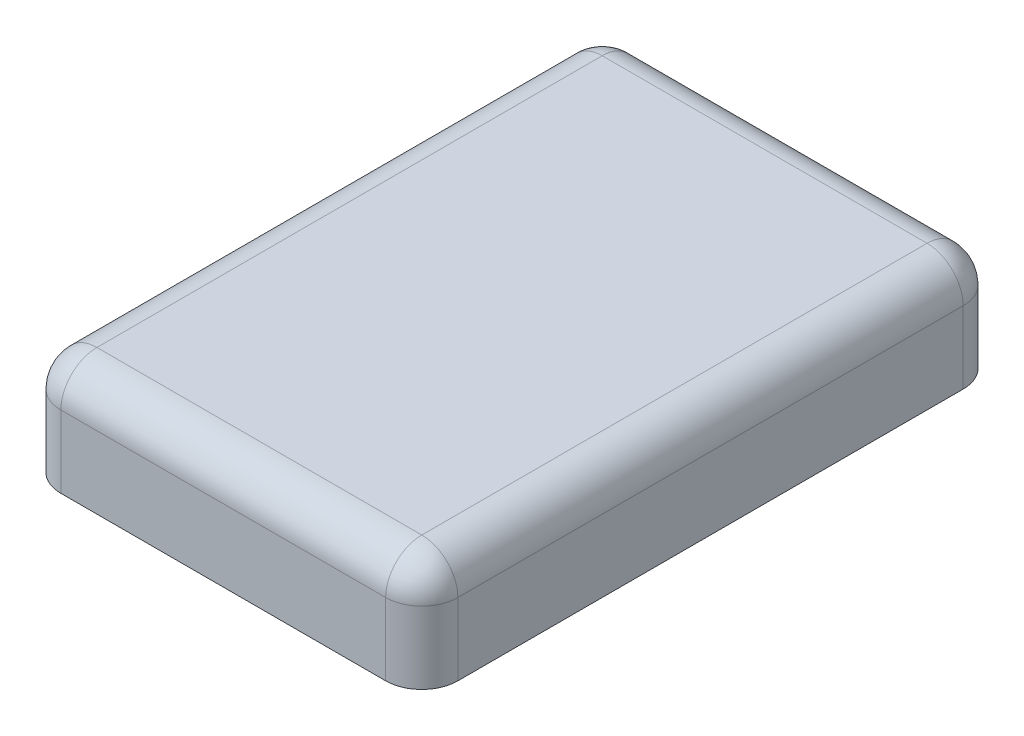
ISO-10303-21;
HEADER;
FILE_DESCRIPTION(('STEP AP214'),'2;1');
FILE_NAME('part.step','',(''),(''),'','','');
FILE_SCHEMA(('AUTOMOTIVE_DESIGN { 1 0 10303 214 1 1 1 1 }'));
ENDSEC;
DATA;
#1=APPLICATION_CONTEXT('core data for automotive mechanical design processes');
#2=APPLICATION_PROTOCOL_DEFINITION('international standard','automotive_design',2000,#1);
#3=PRODUCT_CONTEXT('',#1,'mechanical');
#4=PRODUCT('Part','Part','',(#3));
#5=PRODUCT_RELATED_PRODUCT_CATEGORY('part','',(#4));
#6=PRODUCT_DEFINITION_FORMATION('','',#4);
#7=PRODUCT_DEFINITION_CONTEXT('part definition',#1,'design');
#8=PRODUCT_DEFINITION('design','',#6,#7);
#9=PRODUCT_DEFINITION_SHAPE('','',#8);
#10=(LENGTH_UNIT() NAMED_UNIT(*) SI_UNIT(.MILLI.,.METRE.));
#11=(NAMED_UNIT(*) PLANE_ANGLE_UNIT() SI_UNIT($,.RADIAN.));
#12=(NAMED_UNIT(*) SI_UNIT($,.STERADIAN.) SOLID_ANGLE_UNIT());
#13=UNCERTAINTY_MEASURE_WITH_UNIT(LENGTH_MEASURE(1.E-05),#10,'distance_accuracy_value','');
#14=(GEOMETRIC_REPRESENTATION_CONTEXT(3) GLOBAL_UNCERTAINTY_ASSIGNED_CONTEXT((#13)) GLOBAL_UNIT_ASSIGNED_CONTEXT((#10,
#11,#12)) REPRESENTATION_CONTEXT('',''));
#15=CARTESIAN_POINT('',(0.,0.,0.));
#16=DIRECTION('',(0.,0.,1.));
#17=DIRECTION('',(1.,0.,0.));
#18=AXIS2_PLACEMENT_3D('',#15,#16,#17);
#19=CARTESIAN_POINT('',(1.1,0.6,-1.6));
#20=DIRECTION('',(-1.,0.,0.));
#21=DIRECTION('',(0.,0.,1.));
#22=AXIS2_PLACEMENT_3D('',#19,#20,#21);
#23=PLANE('',#22);
#24=DIRECTION('',(0.,-1.,0.));
#25=VECTOR('',#24,1.);
#26=CARTESIAN_POINT('',(1.1,0.6,-1.4));
#27=LINE('',#26,#25);
#28=CARTESIAN_POINT('',(1.1,0.,-1.4));
#29=VERTEX_POINT('',#28);
#30=CARTESIAN_POINT('',(1.1,0.4,-1.4));
#31=VERTEX_POINT('',#30);
#32=EDGE_CURVE('E121',#29,#31,#27,.F.);
#33=ORIENTED_EDGE('',*,*,#32,.T.);
#34=DIRECTION('',(0.,0.,-1.));
#35=VECTOR('',#34,1.);
#36=CARTESIAN_POINT('',(1.1,0.4,1.4));
#37=LINE('',#36,#35);
#38=CARTESIAN_POINT('',(1.1,0.4,1.4));
#39=VERTEX_POINT('',#38);
#40=EDGE_CURVE('E61',#31,#39,#37,.F.);
#41=ORIENTED_EDGE('',*,*,#40,.T.);
#42=DIRECTION('',(0.,-1.,0.));
#43=VECTOR('',#42,1.);
#44=CARTESIAN_POINT('',(1.1,0.6,1.4));
#45=LINE('',#44,#43);
#46=CARTESIAN_POINT('',(1.1,0.,1.4));
#47=VERTEX_POINT('',#46);
#48=EDGE_CURVE('E114',#39,#47,#45,.T.);
#49=ORIENTED_EDGE('',*,*,#48,.T.);
#50=DIRECTION('',(0.,0.,-1.));
#51=VECTOR('',#50,1.);
#52=CARTESIAN_POINT('',(1.1,0.,-1.6));
#53=LINE('',#52,#51);
#54=EDGE_CURVE('E117',#47,#29,#53,.T.);
#55=ORIENTED_EDGE('',*,*,#54,.T.);
#56=EDGE_LOOP('',(#33,#41,#49,#55));
#57=FACE_BOUND('',#56,.T.);
#58=ADVANCED_FACE('F37',(#57),#23,.F.);
#59=CARTESIAN_POINT('',(-1.1,0.6,-1.6));
#60=DIRECTION('',(0.,0.,1.));
#61=DIRECTION('',(1.,0.,0.));
#62=AXIS2_PLACEMENT_3D('',#59,#60,#61);
#63=PLANE('',#62);
#64=DIRECTION('',(0.,-1.,0.));
#65=VECTOR('',#64,1.);
#66=CARTESIAN_POINT('',(-0.9,0.6,-1.6));
#67=LINE('',#66,#65);
#68=CARTESIAN_POINT('',(-0.9,0.,-1.6));
#69=VERTEX_POINT('',#68);
#70=CARTESIAN_POINT('',(-0.9,0.4,-1.6));
#71=VERTEX_POINT('',#70);
#72=EDGE_CURVE('E154',#69,#71,#67,.F.);
#73=ORIENTED_EDGE('',*,*,#72,.T.);
#74=DIRECTION('',(-1.,0.,0.));
#75=VECTOR('',#74,1.);
#76=CARTESIAN_POINT('',(0.9,0.4,-1.6));
#77=LINE('',#76,#75);
#78=CARTESIAN_POINT('',(0.9,0.4,-1.6));
#79=VERTEX_POINT('',#78);
#80=EDGE_CURVE('E180',#71,#79,#77,.F.);
#81=ORIENTED_EDGE('',*,*,#80,.T.);
#82=DIRECTION('',(0.,-1.,0.));
#83=VECTOR('',#82,1.);
#84=CARTESIAN_POINT('',(0.9,0.6,-1.6));
#85=LINE('',#84,#83);
#86=CARTESIAN_POINT('',(0.9,0.,-1.6));
#87=VERTEX_POINT('',#86);
#88=EDGE_CURVE('E157',#79,#87,#85,.T.);
#89=ORIENTED_EDGE('',*,*,#88,.T.);
#90=DIRECTION('',(-1.,0.,0.));
#91=VECTOR('',#90,1.);
#92=CARTESIAN_POINT('',(-1.1,0.,-1.6));
#93=LINE('',#92,#91);
#94=EDGE_CURVE('E135',#87,#69,#93,.T.);
#95=ORIENTED_EDGE('',*,*,#94,.T.);
#96=EDGE_LOOP('',(#73,#81,#89,#95));
#97=FACE_BOUND('',#96,.T.);
#98=ADVANCED_FACE('F239',(#97),#63,.F.);
#99=CARTESIAN_POINT('',(-1.1,0.6,-1.6));
#100=DIRECTION('',(1.,0.,0.));
#101=DIRECTION('',(0.,0.,-1.));
#102=AXIS2_PLACEMENT_3D('',#99,#100,#101);
#103=PLANE('',#102);
#104=DIRECTION('',(0.,-1.,0.));
#105=VECTOR('',#104,1.);
#106=CARTESIAN_POINT('',(-1.1,0.6,1.4));
#107=LINE('',#106,#105);
#108=CARTESIAN_POINT('',(-1.1,0.,1.4));
#109=VERTEX_POINT('',#108);
#110=CARTESIAN_POINT('',(-1.1,0.4,1.4));
#111=VERTEX_POINT('',#110);
#112=EDGE_CURVE('E161',#109,#111,#107,.F.);
#113=ORIENTED_EDGE('',*,*,#112,.T.);
#114=DIRECTION('',(0.,0.,1.));
#115=VECTOR('',#114,1.);
#116=CARTESIAN_POINT('',(-1.1,0.4,-1.4));
#117=LINE('',#116,#115);
#118=CARTESIAN_POINT('',(-1.1,0.4,-1.4));
#119=VERTEX_POINT('',#118);
#120=EDGE_CURVE('E176',#111,#119,#117,.F.);
#121=ORIENTED_EDGE('',*,*,#120,.T.);
#122=DIRECTION('',(0.,-1.,0.));
#123=VECTOR('',#122,1.);
#124=CARTESIAN_POINT('',(-1.1,0.6,-1.4));
#125=LINE('',#124,#123);
#126=CARTESIAN_POINT('',(-1.1,0.,-1.4));
#127=VERTEX_POINT('',#126);
#128=EDGE_CURVE('E159',#119,#127,#125,.T.);
#129=ORIENTED_EDGE('',*,*,#128,.T.);
#130=DIRECTION('',(0.,0.,1.));
#131=VECTOR('',#130,1.);
#132=CARTESIAN_POINT('',(-1.1,0.,-1.6));
#133=LINE('',#132,#131);
#134=EDGE_CURVE('E138',#127,#109,#133,.T.);
#135=ORIENTED_EDGE('',*,*,#134,.T.);
#136=EDGE_LOOP('',(#113,#121,#129,#135));
#137=FACE_BOUND('',#136,.T.);
#138=ADVANCED_FACE('F244',(#137),#103,.F.);
#139=CARTESIAN_POINT('',(-1.1,0.6,1.6));
#140=DIRECTION('',(0.,0.,-1.));
#141=DIRECTION('',(-1.,0.,0.));
#142=AXIS2_PLACEMENT_3D('',#139,#140,#141);
#143=PLANE('',#142);
#144=DIRECTION('',(0.,-1.,0.));
#145=VECTOR('',#144,1.);
#146=CARTESIAN_POINT('',(0.9,0.6,1.6));
#147=LINE('',#146,#145);
#148=CARTESIAN_POINT('',(0.9,0.,1.6));
#149=VERTEX_POINT('',#148);
#150=CARTESIAN_POINT('',(0.9,0.4,1.6));
#151=VERTEX_POINT('',#150);
#152=EDGE_CURVE('E125',#149,#151,#147,.F.);
#153=ORIENTED_EDGE('',*,*,#152,.T.);
#154=DIRECTION('',(1.,0.,0.));
#155=VECTOR('',#154,1.);
#156=CARTESIAN_POINT('',(-0.9,0.4,1.6));
#157=LINE('',#156,#155);
#158=CARTESIAN_POINT('',(-0.9,0.4,1.6));
#159=VERTEX_POINT('',#158);
#160=EDGE_CURVE('E11',#151,#159,#157,.F.);
#161=ORIENTED_EDGE('',*,*,#160,.T.);
#162=DIRECTION('',(0.,-1.,0.));
#163=VECTOR('',#162,1.);
#164=CARTESIAN_POINT('',(-0.9,0.6,1.6));
#165=LINE('',#164,#163);
#166=CARTESIAN_POINT('',(-0.9,0.,1.6));
#167=VERTEX_POINT('',#166);
#168=EDGE_CURVE('E129',#159,#167,#165,.T.);
#169=ORIENTED_EDGE('',*,*,#168,.T.);
#170=DIRECTION('',(1.,0.,0.));
#171=VECTOR('',#170,1.);
#172=CARTESIAN_POINT('',(-1.1,0.,1.6));
#173=LINE('',#172,#171);
#174=EDGE_CURVE('E145',#167,#149,#173,.T.);
#175=ORIENTED_EDGE('',*,*,#174,.T.);
#176=EDGE_LOOP('',(#153,#161,#169,#175));
#177=FACE_BOUND('',#176,.T.);
#178=ADVANCED_FACE('F355',(#177),#143,.F.);
#179=CARTESIAN_POINT('',(0.,0.6,0.));
#180=DIRECTION('',(0.,1.,0.));
#181=DIRECTION('',(0.,0.,1.));
#182=AXIS2_PLACEMENT_3D('',#179,#180,#181);
#183=PLANE('',#182);
#184=DIRECTION('',(-1.,0.,0.));
#185=VECTOR('',#184,1.);
#186=CARTESIAN_POINT('',(-0.9,0.6,-1.4));
#187=LINE('',#186,#185);
#188=CARTESIAN_POINT('',(0.9,0.6,-1.4));
#189=VERTEX_POINT('',#188);
#190=CARTESIAN_POINT('',(-0.9,0.6,-1.4));
#191=VERTEX_POINT('',#190);
#192=EDGE_CURVE('E171',#189,#191,#187,.T.);
#193=ORIENTED_EDGE('',*,*,#192,.T.);
#194=DIRECTION('',(0.,0.,1.));
#195=VECTOR('',#194,1.);
#196=CARTESIAN_POINT('',(-0.9,0.6,1.4));
#197=LINE('',#196,#195);
#198=CARTESIAN_POINT('',(-0.9,0.6,1.4));
#199=VERTEX_POINT('',#198);
#200=EDGE_CURVE('E173',#191,#199,#197,.T.);
#201=ORIENTED_EDGE('',*,*,#200,.T.);
#202=DIRECTION('',(1.,0.,0.));
#203=VECTOR('',#202,1.);
#204=CARTESIAN_POINT('',(0.9,0.6,1.4));
#205=LINE('',#204,#203);
#206=CARTESIAN_POINT('',(0.9,0.6,1.4));
#207=VERTEX_POINT('',#206);
#208=EDGE_CURVE('E167',#199,#207,#205,.T.);
#209=ORIENTED_EDGE('',*,*,#208,.T.);
#210=DIRECTION('',(0.,0.,-1.));
#211=VECTOR('',#210,1.);
#212=CARTESIAN_POINT('',(0.9,0.6,-1.4));
#213=LINE('',#212,#211);
#214=EDGE_CURVE('E169',#207,#189,#213,.T.);
#215=ORIENTED_EDGE('',*,*,#214,.T.);
#216=EDGE_LOOP('',(#193,#201,#209,#215));
#217=FACE_BOUND('',#216,.T.);
#218=ADVANCED_FACE('F216',(#217),#183,.T.);
#219=CARTESIAN_POINT('',(0.,0.,0.));
#220=DIRECTION('',(0.,1.,0.));
#221=DIRECTION('',(0.,0.,1.));
#222=AXIS2_PLACEMENT_3D('',#219,#220,#221);
#223=PLANE('',#222);
#224=ORIENTED_EDGE('',*,*,#54,.F.);
#225=CARTESIAN_POINT('',(0.9,0.,1.4));
#226=DIRECTION('',(0.,1.,0.));
#227=DIRECTION('',(0.,0.,1.));
#228=AXIS2_PLACEMENT_3D('',#225,#226,#227);
#229=CIRCLE('',#228,0.2);
#230=EDGE_CURVE('E123',#47,#149,#229,.F.);
#231=ORIENTED_EDGE('',*,*,#230,.T.);
#232=ORIENTED_EDGE('',*,*,#174,.F.);
#233=CARTESIAN_POINT('',(-0.9,0.,1.4));
#234=DIRECTION('',(0.,1.,0.));
#235=DIRECTION('',(0.,0.,1.));
#236=AXIS2_PLACEMENT_3D('',#233,#234,#235);
#237=CIRCLE('',#236,0.2);
#238=EDGE_CURVE('E149',#167,#109,#237,.F.);
#239=ORIENTED_EDGE('',*,*,#238,.T.);
#240=ORIENTED_EDGE('',*,*,#134,.F.);
#241=CARTESIAN_POINT('',(-0.9,0.,-1.4));
#242=DIRECTION('',(0.,1.,0.));
#243=DIRECTION('',(0.,0.,1.));
#244=AXIS2_PLACEMENT_3D('',#241,#242,#243);
#245=CIRCLE('',#244,0.2);
#246=EDGE_CURVE('E120',#127,#69,#245,.F.);
#247=ORIENTED_EDGE('',*,*,#246,.T.);
#248=ORIENTED_EDGE('',*,*,#94,.F.);
#249=CARTESIAN_POINT('',(0.9,0.,-1.4));
#250=DIRECTION('',(0.,1.,0.));
#251=DIRECTION('',(0.,0.,1.));
#252=AXIS2_PLACEMENT_3D('',#249,#250,#251);
#253=CIRCLE('',#252,0.2);
#254=EDGE_CURVE('E130',#87,#29,#253,.F.);
#255=ORIENTED_EDGE('',*,*,#254,.T.);
#256=EDGE_LOOP('',(#224,#231,#232,#239,#240,#247,#248,#255));
#257=FACE_BOUND('',#256,.T.);
#258=ADVANCED_FACE('F132',(#257),#223,.F.);
#259=CARTESIAN_POINT('',(0.9,0.6,1.4));
#260=DIRECTION('',(0.,-1.,0.));
#261=DIRECTION('',(0.,0.,-1.));
#262=AXIS2_PLACEMENT_3D('',#259,#260,#261);
#263=CYLINDRICAL_SURFACE('',#262,0.2);
#264=ORIENTED_EDGE('',*,*,#48,.F.);
#265=CARTESIAN_POINT('',(0.9,0.4,1.4));
#266=DIRECTION('',(0.,-1.,0.));
#267=DIRECTION('',(0.,0.,-1.));
#268=AXIS2_PLACEMENT_3D('',#265,#266,#267);
#269=CIRCLE('',#268,0.2);
#270=EDGE_CURVE('E46',#39,#151,#269,.T.);
#271=ORIENTED_EDGE('',*,*,#270,.T.);
#272=ORIENTED_EDGE('',*,*,#152,.F.);
#273=ORIENTED_EDGE('',*,*,#230,.F.);
#274=EDGE_LOOP('',(#264,#271,#272,#273));
#275=FACE_BOUND('',#274,.T.);
#276=ADVANCED_FACE('F124',(#275),#263,.T.);
#277=CARTESIAN_POINT('',(0.9,0.6,-1.4));
#278=DIRECTION('',(0.,-1.,0.));
#279=DIRECTION('',(0.,0.,-1.));
#280=AXIS2_PLACEMENT_3D('',#277,#278,#279);
#281=CYLINDRICAL_SURFACE('',#280,0.2);
#282=ORIENTED_EDGE('',*,*,#88,.F.);
#283=CARTESIAN_POINT('',(0.9,0.4,-1.4));
#284=DIRECTION('',(0.,-1.,0.));
#285=DIRECTION('',(0.,0.,-1.));
#286=AXIS2_PLACEMENT_3D('',#283,#284,#285);
#287=CIRCLE('',#286,0.2);
#288=EDGE_CURVE('E182',#79,#31,#287,.T.);
#289=ORIENTED_EDGE('',*,*,#288,.T.);
#290=ORIENTED_EDGE('',*,*,#32,.F.);
#291=ORIENTED_EDGE('',*,*,#254,.F.);
#292=EDGE_LOOP('',(#282,#289,#290,#291));
#293=FACE_BOUND('',#292,.T.);
#294=ADVANCED_FACE('F251',(#293),#281,.T.);
#295=CARTESIAN_POINT('',(-0.9,0.6,1.4));
#296=DIRECTION('',(0.,-1.,0.));
#297=DIRECTION('',(0.,0.,-1.));
#298=AXIS2_PLACEMENT_3D('',#295,#296,#297);
#299=CYLINDRICAL_SURFACE('',#298,0.2);
#300=ORIENTED_EDGE('',*,*,#168,.F.);
#301=CARTESIAN_POINT('',(-0.9,0.4,1.4));
#302=DIRECTION('',(0.,-1.,0.));
#303=DIRECTION('',(0.,0.,-1.));
#304=AXIS2_PLACEMENT_3D('',#301,#302,#303);
#305=CIRCLE('',#304,0.2);
#306=EDGE_CURVE('E164',#159,#111,#305,.T.);
#307=ORIENTED_EDGE('',*,*,#306,.T.);
#308=ORIENTED_EDGE('',*,*,#112,.F.);
#309=ORIENTED_EDGE('',*,*,#238,.F.);
#310=EDGE_LOOP('',(#300,#307,#308,#309));
#311=FACE_BOUND('',#310,.T.);
#312=ADVANCED_FACE('F254',(#311),#299,.T.);
#313=CARTESIAN_POINT('',(-0.9,0.6,-1.4));
#314=DIRECTION('',(0.,-1.,0.));
#315=DIRECTION('',(0.,0.,-1.));
#316=AXIS2_PLACEMENT_3D('',#313,#314,#315);
#317=CYLINDRICAL_SURFACE('',#316,0.2);
#318=ORIENTED_EDGE('',*,*,#128,.F.);
#319=CARTESIAN_POINT('',(-0.9,0.4,-1.4));
#320=DIRECTION('',(0.,-1.,0.));
#321=DIRECTION('',(0.,0.,-1.));
#322=AXIS2_PLACEMENT_3D('',#319,#320,#321);
#323=CIRCLE('',#322,0.2);
#324=EDGE_CURVE('E178',#119,#71,#323,.T.);
#325=ORIENTED_EDGE('',*,*,#324,.T.);
#326=ORIENTED_EDGE('',*,*,#72,.F.);
#327=ORIENTED_EDGE('',*,*,#246,.F.);
#328=EDGE_LOOP('',(#318,#325,#326,#327));
#329=FACE_BOUND('',#328,.T.);
#330=ADVANCED_FACE('F258',(#329),#317,.T.);
#331=CARTESIAN_POINT('',(0.9,0.4,-1.4));
#332=DIRECTION('',(0.,1.,0.));
#333=DIRECTION('',(0.,0.,1.));
#334=AXIS2_PLACEMENT_3D('',#331,#332,#333);
#335=SPHERICAL_SURFACE('',#334,0.2);
#336=CARTESIAN_POINT('',(0.9,0.4,-1.4));
#337=DIRECTION('',(0.,0.,1.));
#338=DIRECTION('',(1.,0.,0.));
#339=AXIS2_PLACEMENT_3D('',#336,#337,#338);
#340=CIRCLE('',#339,0.2);
#341=EDGE_CURVE('E141',#31,#189,#340,.T.);
#342=ORIENTED_EDGE('',*,*,#341,.F.);
#343=ORIENTED_EDGE('',*,*,#288,.F.);
#344=CARTESIAN_POINT('',(0.9,0.4,-1.4));
#345=DIRECTION('',(-1.,0.,0.));
#346=DIRECTION('',(0.,0.,1.));
#347=AXIS2_PLACEMENT_3D('',#344,#345,#346);
#348=CIRCLE('',#347,0.2);
#349=EDGE_CURVE('E41',#189,#79,#348,.T.);
#350=ORIENTED_EDGE('',*,*,#349,.F.);
#351=EDGE_LOOP('',(#342,#343,#350));
#352=FACE_BOUND('',#351,.T.);
#353=ADVANCED_FACE('F39',(#352),#335,.T.);
#354=CARTESIAN_POINT('',(0.,0.4,-1.4));
#355=DIRECTION('',(1.,0.,0.));
#356=DIRECTION('',(0.,0.,-1.));
#357=AXIS2_PLACEMENT_3D('',#354,#355,#356);
#358=CYLINDRICAL_SURFACE('',#357,0.2);
#359=ORIENTED_EDGE('',*,*,#349,.T.);
#360=ORIENTED_EDGE('',*,*,#80,.F.);
#361=CARTESIAN_POINT('',(-0.9,0.4,-1.4));
#362=DIRECTION('',(-1.,0.,0.));
#363=DIRECTION('',(0.,0.,1.));
#364=AXIS2_PLACEMENT_3D('',#361,#362,#363);
#365=CIRCLE('',#364,0.2);
#366=EDGE_CURVE('E199',#191,#71,#365,.T.);
#367=ORIENTED_EDGE('',*,*,#366,.F.);
#368=ORIENTED_EDGE('',*,*,#192,.F.);
#369=EDGE_LOOP('',(#359,#360,#367,#368));
#370=FACE_BOUND('',#369,.T.);
#371=ADVANCED_FACE('F213',(#370),#358,.T.);
#372=CARTESIAN_POINT('',(0.9,0.4,0.));
#373=DIRECTION('',(0.,0.,1.));
#374=DIRECTION('',(1.,0.,0.));
#375=AXIS2_PLACEMENT_3D('',#372,#373,#374);
#376=CYLINDRICAL_SURFACE('',#375,0.2);
#377=ORIENTED_EDGE('',*,*,#341,.T.);
#378=ORIENTED_EDGE('',*,*,#214,.F.);
#379=CARTESIAN_POINT('',(0.9,0.4,1.4));
#380=DIRECTION('',(0.,0.,1.));
#381=DIRECTION('',(1.,0.,0.));
#382=AXIS2_PLACEMENT_3D('',#379,#380,#381);
#383=CIRCLE('',#382,0.2);
#384=EDGE_CURVE('E196',#39,#207,#383,.T.);
#385=ORIENTED_EDGE('',*,*,#384,.F.);
#386=ORIENTED_EDGE('',*,*,#40,.F.);
#387=EDGE_LOOP('',(#377,#378,#385,#386));
#388=FACE_BOUND('',#387,.T.);
#389=ADVANCED_FACE('F206',(#388),#376,.T.);
#390=CARTESIAN_POINT('',(-0.9,0.4,-1.4));
#391=DIRECTION('',(0.,1.,0.));
#392=DIRECTION('',(0.,0.,1.));
#393=AXIS2_PLACEMENT_3D('',#390,#391,#392);
#394=SPHERICAL_SURFACE('',#393,0.2);
#395=ORIENTED_EDGE('',*,*,#366,.T.);
#396=ORIENTED_EDGE('',*,*,#324,.F.);
#397=CARTESIAN_POINT('',(-0.9,0.4,-1.4));
#398=DIRECTION('',(0.,0.,1.));
#399=DIRECTION('',(1.,0.,0.));
#400=AXIS2_PLACEMENT_3D('',#397,#398,#399);
#401=CIRCLE('',#400,0.2);
#402=EDGE_CURVE('E193',#191,#119,#401,.T.);
#403=ORIENTED_EDGE('',*,*,#402,.F.);
#404=EDGE_LOOP('',(#395,#396,#403));
#405=FACE_BOUND('',#404,.T.);
#406=ADVANCED_FACE('F228',(#405),#394,.T.);
#407=CARTESIAN_POINT('',(0.9,0.4,1.4));
#408=DIRECTION('',(0.,1.,0.));
#409=DIRECTION('',(0.,0.,1.));
#410=AXIS2_PLACEMENT_3D('',#407,#408,#409);
#411=SPHERICAL_SURFACE('',#410,0.2);
#412=ORIENTED_EDGE('',*,*,#270,.F.);
#413=ORIENTED_EDGE('',*,*,#384,.T.);
#414=CARTESIAN_POINT('',(0.9,0.4,1.4));
#415=DIRECTION('',(-1.,0.,0.));
#416=DIRECTION('',(0.,0.,1.));
#417=AXIS2_PLACEMENT_3D('',#414,#415,#416);
#418=CIRCLE('',#417,0.2);
#419=EDGE_CURVE('E190',#151,#207,#418,.T.);
#420=ORIENTED_EDGE('',*,*,#419,.F.);
#421=EDGE_LOOP('',(#412,#413,#420));
#422=FACE_BOUND('',#421,.T.);
#423=ADVANCED_FACE('F225',(#422),#411,.T.);
#424=CARTESIAN_POINT('',(-0.9,0.4,0.));
#425=DIRECTION('',(0.,0.,-1.));
#426=DIRECTION('',(-1.,0.,0.));
#427=AXIS2_PLACEMENT_3D('',#424,#425,#426);
#428=CYLINDRICAL_SURFACE('',#427,0.2);
#429=ORIENTED_EDGE('',*,*,#402,.T.);
#430=ORIENTED_EDGE('',*,*,#120,.F.);
#431=CARTESIAN_POINT('',(-0.9,0.4,1.4));
#432=DIRECTION('',(0.,0.,1.));
#433=DIRECTION('',(1.,0.,0.));
#434=AXIS2_PLACEMENT_3D('',#431,#432,#433);
#435=CIRCLE('',#434,0.2);
#436=EDGE_CURVE('E188',#199,#111,#435,.T.);
#437=ORIENTED_EDGE('',*,*,#436,.F.);
#438=ORIENTED_EDGE('',*,*,#200,.F.);
#439=EDGE_LOOP('',(#429,#430,#437,#438));
#440=FACE_BOUND('',#439,.T.);
#441=ADVANCED_FACE('F227',(#440),#428,.T.);
#442=CARTESIAN_POINT('',(0.,0.4,1.4));
#443=DIRECTION('',(-1.,0.,0.));
#444=DIRECTION('',(0.,0.,1.));
#445=AXIS2_PLACEMENT_3D('',#442,#443,#444);
#446=CYLINDRICAL_SURFACE('',#445,0.2);
#447=ORIENTED_EDGE('',*,*,#419,.T.);
#448=ORIENTED_EDGE('',*,*,#208,.F.);
#449=CARTESIAN_POINT('',(-0.9,0.4,1.4));
#450=DIRECTION('',(-1.,0.,0.));
#451=DIRECTION('',(0.,0.,1.));
#452=AXIS2_PLACEMENT_3D('',#449,#450,#451);
#453=CIRCLE('',#452,0.2);
#454=EDGE_CURVE('E186',#159,#199,#453,.T.);
#455=ORIENTED_EDGE('',*,*,#454,.F.);
#456=ORIENTED_EDGE('',*,*,#160,.F.);
#457=EDGE_LOOP('',(#447,#448,#455,#456));
#458=FACE_BOUND('',#457,.T.);
#459=ADVANCED_FACE('F221',(#458),#446,.T.);
#460=CARTESIAN_POINT('',(-0.9,0.4,1.4));
#461=DIRECTION('',(0.,1.,0.));
#462=DIRECTION('',(0.,0.,1.));
#463=AXIS2_PLACEMENT_3D('',#460,#461,#462);
#464=SPHERICAL_SURFACE('',#463,0.2);
#465=ORIENTED_EDGE('',*,*,#436,.T.);
#466=ORIENTED_EDGE('',*,*,#306,.F.);
#467=ORIENTED_EDGE('',*,*,#454,.T.);
#468=EDGE_LOOP('',(#465,#466,#467));
#469=FACE_BOUND('',#468,.T.);
#470=ADVANCED_FACE('F263',(#469),#464,.T.);
#471=CLOSED_SHELL('',(#58,#98,#138,#178,#218,#258,#276,#294,#312,#330,#353,#371,#389,#406,#423,
#441,#459,#470));
#472=MANIFOLD_SOLID_BREP('B2',#471);
#473=ADVANCED_BREP_SHAPE_REPRESENTATION('',(#18,#472),#14);
#474=SHAPE_DEFINITION_REPRESENTATION(#9,#473);
ENDSEC;
END-ISO-10303-21;
